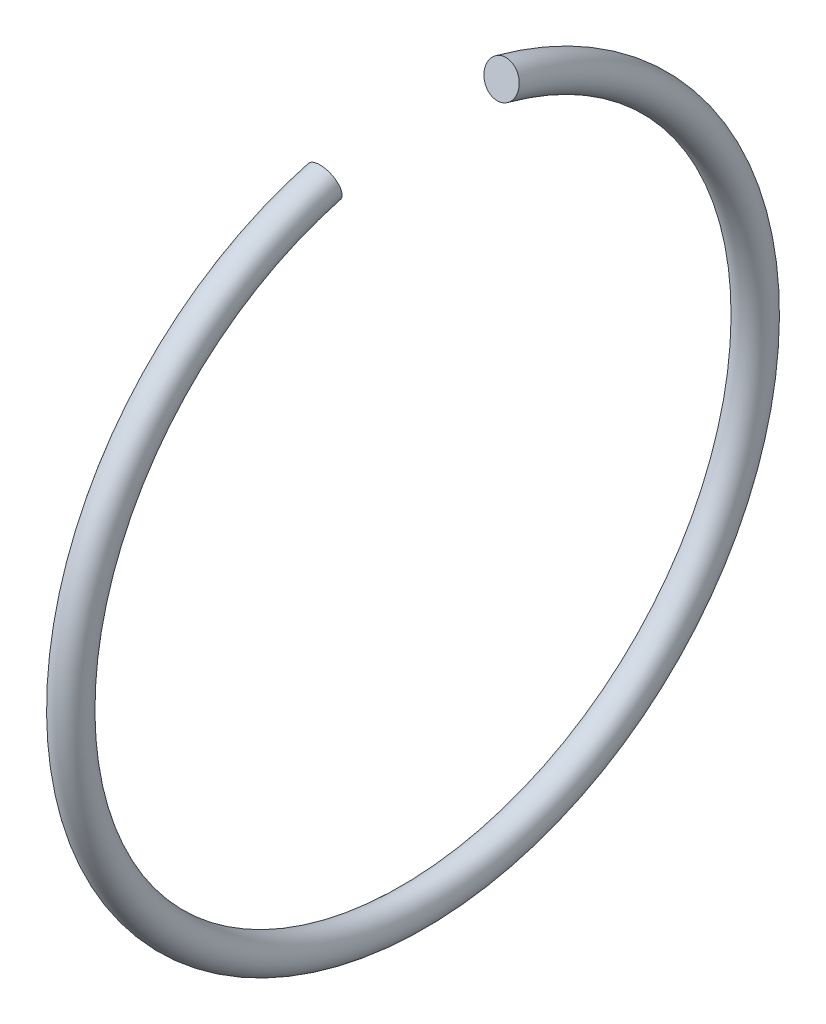
ISO-10303-21;
HEADER;
FILE_DESCRIPTION(('STEP AP214'),'2;1');
FILE_NAME('part.step','',(''),(''),'','','');
FILE_SCHEMA(('AUTOMOTIVE_DESIGN { 1 0 10303 214 1 1 1 1 }'));
ENDSEC;
DATA;
#1=APPLICATION_CONTEXT('core data for automotive mechanical design processes');
#2=APPLICATION_PROTOCOL_DEFINITION('international standard','automotive_design',2000,#1);
#3=PRODUCT_CONTEXT('',#1,'mechanical');
#4=PRODUCT('Part','Part','',(#3));
#5=PRODUCT_RELATED_PRODUCT_CATEGORY('part','',(#4));
#6=PRODUCT_DEFINITION_FORMATION('','',#4);
#7=PRODUCT_DEFINITION_CONTEXT('part definition',#1,'design');
#8=PRODUCT_DEFINITION('design','',#6,#7);
#9=PRODUCT_DEFINITION_SHAPE('','',#8);
#10=(LENGTH_UNIT() NAMED_UNIT(*) SI_UNIT(.MILLI.,.METRE.));
#11=(NAMED_UNIT(*) PLANE_ANGLE_UNIT() SI_UNIT($,.RADIAN.));
#12=(NAMED_UNIT(*) SI_UNIT($,.STERADIAN.) SOLID_ANGLE_UNIT());
#13=UNCERTAINTY_MEASURE_WITH_UNIT(LENGTH_MEASURE(1.E-05),#10,'distance_accuracy_value','');
#14=(GEOMETRIC_REPRESENTATION_CONTEXT(3) GLOBAL_UNCERTAINTY_ASSIGNED_CONTEXT((#13)) GLOBAL_UNIT_ASSIGNED_CONTEXT((#10,
#11,#12)) REPRESENTATION_CONTEXT('',''));
#15=CARTESIAN_POINT('',(0.,0.,0.));
#16=DIRECTION('',(0.,0.,1.));
#17=DIRECTION('',(1.,0.,0.));
#18=AXIS2_PLACEMENT_3D('',#15,#16,#17);
#19=CARTESIAN_POINT('',(-213.8,0.,0.));
#20=DIRECTION('',(1.,0.,0.));
#21=DIRECTION('',(0.,1.,0.));
#22=AXIS2_PLACEMENT_3D('',#19,#20,#21);
#23=TOROIDAL_SURFACE('',#22,25.,1.25000000000001);
#24=CARTESIAN_POINT('',(-213.8,24.1481456572268,6.47047612756284));
#25=DIRECTION('',(0.,0.258819045102515,-0.96592582628907));
#26=DIRECTION('',(1.,0.,0.));
#27=AXIS2_PLACEMENT_3D('',#24,#25,#26);
#28=CIRCLE('',#27,1.25000000000001);
#29=CARTESIAN_POINT('',(-213.8,25.3555529400881,6.79399993394098));
#30=VERTEX_POINT('',#29);
#31=EDGE_CURVE('E10',#30,#30,#28,.T.);
#32=CARTESIAN_POINT('',(-213.8,24.1481456572268,-6.47047612756289));
#33=DIRECTION('',(0.,-0.258819045102515,-0.96592582628907));
#34=DIRECTION('',(1.,0.,0.));
#35=AXIS2_PLACEMENT_3D('',#32,#33,#34);
#36=CIRCLE('',#35,1.25000000000001);
#37=CARTESIAN_POINT('',(-213.8,25.3555529400881,-6.79399993394103));
#38=VERTEX_POINT('',#37);
#39=EDGE_CURVE('E40',#38,#38,#36,.T.);
#40=CARTESIAN_POINT('',(-213.8,0.,0.));
#41=DIRECTION('',(1.,0.,0.));
#42=DIRECTION('',(0.,1.,0.));
#43=AXIS2_PLACEMENT_3D('',#40,#41,#42);
#44=CIRCLE('',#43,26.25);
#45=EDGE_CURVE('',#30,#38,#44,.T.);
#46=ORIENTED_EDGE('',*,*,#31,.F.);
#47=ORIENTED_EDGE('',*,*,#39,.T.);
#48=ORIENTED_EDGE('',*,*,#45,.T.);
#49=ORIENTED_EDGE('',*,*,#45,.F.);
#50=EDGE_LOOP('',(#46,#48,#47,#49));
#51=FACE_BOUND('',#50,.T.);
#52=ADVANCED_FACE('F34',(#51),#23,.T.);
#53=CARTESIAN_POINT('',(-213.8,24.1481456572268,6.47047612756284));
#54=DIRECTION('',(0.,0.258819045102515,-0.96592582628907));
#55=DIRECTION('',(1.,0.,0.));
#56=AXIS2_PLACEMENT_3D('',#53,#54,#55);
#57=PLANE('',#56);
#58=ORIENTED_EDGE('',*,*,#31,.T.);
#59=EDGE_LOOP('',(#58));
#60=FACE_BOUND('',#59,.T.);
#61=ADVANCED_FACE('F49',(#60),#57,.T.);
#62=CARTESIAN_POINT('',(-213.8,24.1481456572268,-6.47047612756289));
#63=DIRECTION('',(0.,-0.258819045102515,-0.96592582628907));
#64=DIRECTION('',(1.,0.,0.));
#65=AXIS2_PLACEMENT_3D('',#62,#63,#64);
#66=PLANE('',#65);
#67=ORIENTED_EDGE('',*,*,#39,.F.);
#68=EDGE_LOOP('',(#67));
#69=FACE_BOUND('',#68,.T.);
#70=ADVANCED_FACE('F47',(#69),#66,.F.);
#71=CLOSED_SHELL('',(#52,#61,#70));
#72=MANIFOLD_SOLID_BREP('B2',#71);
#73=ADVANCED_BREP_SHAPE_REPRESENTATION('',(#18,#72),#14);
#74=SHAPE_DEFINITION_REPRESENTATION(#9,#73);
ENDSEC;
END-ISO-10303-21;
